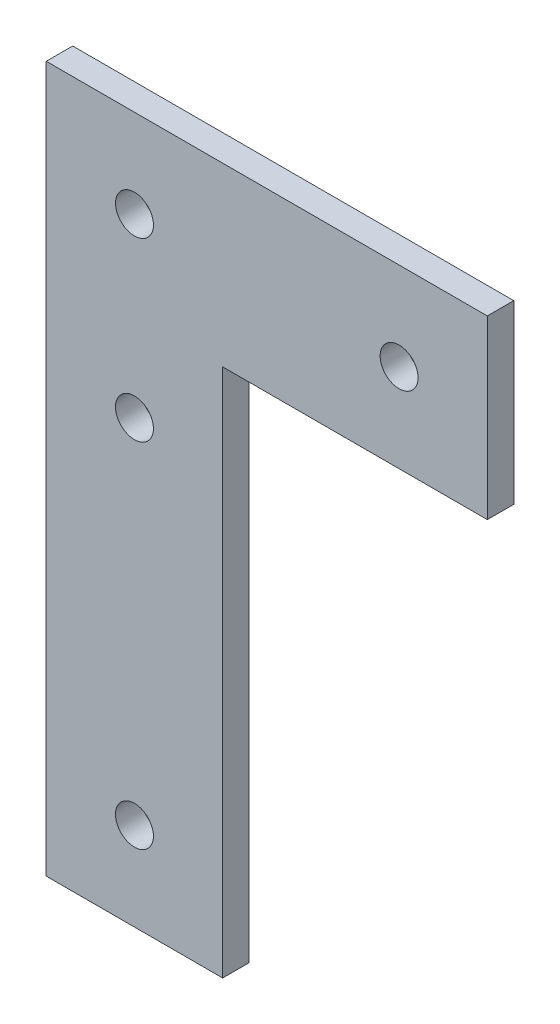
ISO-10303-21;
HEADER;
FILE_DESCRIPTION(('STEP AP214'),'2;1');
FILE_NAME('part.step','',(''),(''),'','','');
FILE_SCHEMA(('AUTOMOTIVE_DESIGN { 1 0 10303 214 1 1 1 1 }'));
ENDSEC;
DATA;
#1=APPLICATION_CONTEXT('core data for automotive mechanical design processes');
#2=APPLICATION_PROTOCOL_DEFINITION('international standard','automotive_design',2000,#1);
#3=PRODUCT_CONTEXT('',#1,'mechanical');
#4=PRODUCT('Part','Part','',(#3));
#5=PRODUCT_RELATED_PRODUCT_CATEGORY('part','',(#4));
#6=PRODUCT_DEFINITION_FORMATION('','',#4);
#7=PRODUCT_DEFINITION_CONTEXT('part definition',#1,'design');
#8=PRODUCT_DEFINITION('design','',#6,#7);
#9=PRODUCT_DEFINITION_SHAPE('','',#8);
#10=(LENGTH_UNIT() NAMED_UNIT(*) SI_UNIT(.MILLI.,.METRE.));
#11=(NAMED_UNIT(*) PLANE_ANGLE_UNIT() SI_UNIT($,.RADIAN.));
#12=(NAMED_UNIT(*) SI_UNIT($,.STERADIAN.) SOLID_ANGLE_UNIT());
#13=UNCERTAINTY_MEASURE_WITH_UNIT(LENGTH_MEASURE(1.E-05),#10,'distance_accuracy_value','');
#14=(GEOMETRIC_REPRESENTATION_CONTEXT(3) GLOBAL_UNCERTAINTY_ASSIGNED_CONTEXT((#13)) GLOBAL_UNIT_ASSIGNED_CONTEXT((#10,
#11,#12)) REPRESENTATION_CONTEXT('',''));
#15=CARTESIAN_POINT('',(0.,0.,0.));
#16=DIRECTION('',(0.,0.,1.));
#17=DIRECTION('',(1.,0.,0.));
#18=AXIS2_PLACEMENT_3D('',#15,#16,#17);
#19=CARTESIAN_POINT('',(0.,0.,3.));
#20=DIRECTION('',(0.,0.,-1.));
#21=DIRECTION('',(-1.,0.,0.));
#22=AXIS2_PLACEMENT_3D('',#19,#20,#21);
#23=PLANE('',#22);
#24=DIRECTION('',(0.,1.,0.));
#25=VECTOR('',#24,1.);
#26=CARTESIAN_POINT('',(-300.612129760226,147.905049365304,3.));
#27=LINE('',#26,#25);
#28=CARTESIAN_POINT('',(-300.612129760226,127.905049365303,3.));
#29=VERTEX_POINT('',#28);
#30=CARTESIAN_POINT('',(-300.612129760226,147.905049365304,3.));
#31=VERTEX_POINT('',#30);
#32=EDGE_CURVE('E132',#29,#31,#27,.T.);
#33=ORIENTED_EDGE('',*,*,#32,.T.);
#34=DIRECTION('',(-1.,0.,0.));
#35=VECTOR('',#34,1.);
#36=CARTESIAN_POINT('',(-300.612129760226,147.905049365304,3.));
#37=LINE('',#36,#35);
#38=CARTESIAN_POINT('',(-350.612129760226,147.905049365304,3.));
#39=VERTEX_POINT('',#38);
#40=EDGE_CURVE('E89',#31,#39,#37,.T.);
#41=ORIENTED_EDGE('',*,*,#40,.T.);
#42=DIRECTION('',(0.,-1.,0.));
#43=VECTOR('',#42,1.);
#44=CARTESIAN_POINT('',(-350.612129760226,147.905049365304,3.));
#45=LINE('',#44,#43);
#46=CARTESIAN_POINT('',(-350.612129760226,67.9050493653035,3.));
#47=VERTEX_POINT('',#46);
#48=EDGE_CURVE('E102',#39,#47,#45,.T.);
#49=ORIENTED_EDGE('',*,*,#48,.T.);
#50=DIRECTION('',(1.,0.,0.));
#51=VECTOR('',#50,1.);
#52=CARTESIAN_POINT('',(-350.612129760226,67.9050493653035,3.));
#53=LINE('',#52,#51);
#54=CARTESIAN_POINT('',(-330.612129760226,67.9050493653035,3.));
#55=VERTEX_POINT('',#54);
#56=EDGE_CURVE('E96',#47,#55,#53,.T.);
#57=ORIENTED_EDGE('',*,*,#56,.T.);
#58=DIRECTION('',(0.,1.,0.));
#59=VECTOR('',#58,1.);
#60=CARTESIAN_POINT('',(-330.612129760226,67.9050493653035,3.));
#61=LINE('',#60,#59);
#62=CARTESIAN_POINT('',(-330.612129760226,127.905049365303,3.));
#63=VERTEX_POINT('',#62);
#64=EDGE_CURVE('E100',#55,#63,#61,.T.);
#65=ORIENTED_EDGE('',*,*,#64,.T.);
#66=DIRECTION('',(1.,0.,0.));
#67=VECTOR('',#66,1.);
#68=CARTESIAN_POINT('',(-300.612129760226,127.905049365303,3.));
#69=LINE('',#68,#67);
#70=EDGE_CURVE('E52',#63,#29,#69,.T.);
#71=ORIENTED_EDGE('',*,*,#70,.T.);
#72=EDGE_LOOP('',(#33,#41,#49,#57,#65,#71));
#73=FACE_BOUND('',#72,.T.);
#74=CARTESIAN_POINT('',(-340.612129760226,77.9050493653034,3.));
#75=DIRECTION('',(0.,0.,1.));
#76=DIRECTION('',(1.,0.,0.));
#77=AXIS2_PLACEMENT_3D('',#74,#75,#76);
#78=CIRCLE('',#77,2.15000000000007);
#79=CARTESIAN_POINT('',(-338.462129760226,77.9050493653034,3.));
#80=VERTEX_POINT('',#79);
#81=EDGE_CURVE('E124',#80,#80,#78,.T.);
#82=ORIENTED_EDGE('',*,*,#81,.F.);
#83=EDGE_LOOP('',(#82));
#84=FACE_BOUND('',#83,.T.);
#85=CARTESIAN_POINT('',(-340.612129760226,117.905049365303,3.));
#86=DIRECTION('',(0.,0.,1.));
#87=DIRECTION('',(1.,0.,0.));
#88=AXIS2_PLACEMENT_3D('',#85,#86,#87);
#89=CIRCLE('',#88,2.15000000000007);
#90=CARTESIAN_POINT('',(-338.462129760226,117.905049365303,3.));
#91=VERTEX_POINT('',#90);
#92=EDGE_CURVE('E196',#91,#91,#89,.T.);
#93=ORIENTED_EDGE('',*,*,#92,.F.);
#94=EDGE_LOOP('',(#93));
#95=FACE_BOUND('',#94,.T.);
#96=CARTESIAN_POINT('',(-340.612129760226,137.905049365303,3.));
#97=DIRECTION('',(0.,0.,1.));
#98=DIRECTION('',(1.,0.,0.));
#99=AXIS2_PLACEMENT_3D('',#96,#97,#98);
#100=CIRCLE('',#99,2.15000000000007);
#101=CARTESIAN_POINT('',(-338.462129760226,137.905049365303,3.));
#102=VERTEX_POINT('',#101);
#103=EDGE_CURVE('E190',#102,#102,#100,.T.);
#104=ORIENTED_EDGE('',*,*,#103,.F.);
#105=EDGE_LOOP('',(#104));
#106=FACE_BOUND('',#105,.T.);
#107=CARTESIAN_POINT('',(-310.612129760226,137.905049365303,3.));
#108=DIRECTION('',(0.,0.,1.));
#109=DIRECTION('',(1.,0.,0.));
#110=AXIS2_PLACEMENT_3D('',#107,#108,#109);
#111=CIRCLE('',#110,2.15000000000007);
#112=CARTESIAN_POINT('',(-308.462129760226,137.905049365303,3.));
#113=VERTEX_POINT('',#112);
#114=EDGE_CURVE('E181',#113,#113,#111,.T.);
#115=ORIENTED_EDGE('',*,*,#114,.F.);
#116=EDGE_LOOP('',(#115));
#117=FACE_BOUND('',#116,.T.);
#118=ADVANCED_FACE('F35',(#73,#84,#95,#106,#117),#23,.F.);
#119=CARTESIAN_POINT('',(0.,0.,0.));
#120=DIRECTION('',(0.,0.,-1.));
#121=DIRECTION('',(-1.,0.,0.));
#122=AXIS2_PLACEMENT_3D('',#119,#120,#121);
#123=PLANE('',#122);
#124=CARTESIAN_POINT('',(-340.612129760226,137.905049365303,0.));
#125=DIRECTION('',(0.,0.,1.));
#126=DIRECTION('',(1.,0.,0.));
#127=AXIS2_PLACEMENT_3D('',#124,#125,#126);
#128=CIRCLE('',#127,2.15000000000007);
#129=CARTESIAN_POINT('',(-338.462129760226,137.905049365303,0.));
#130=VERTEX_POINT('',#129);
#131=EDGE_CURVE('E187',#130,#130,#128,.T.);
#132=ORIENTED_EDGE('',*,*,#131,.T.);
#133=EDGE_LOOP('',(#132));
#134=FACE_BOUND('',#133,.T.);
#135=CARTESIAN_POINT('',(-340.612129760226,77.9050493653034,0.));
#136=DIRECTION('',(0.,0.,1.));
#137=DIRECTION('',(1.,0.,0.));
#138=AXIS2_PLACEMENT_3D('',#135,#136,#137);
#139=CIRCLE('',#138,2.15000000000007);
#140=CARTESIAN_POINT('',(-338.462129760226,77.9050493653034,0.));
#141=VERTEX_POINT('',#140);
#142=EDGE_CURVE('E199',#141,#141,#139,.T.);
#143=ORIENTED_EDGE('',*,*,#142,.T.);
#144=EDGE_LOOP('',(#143));
#145=FACE_BOUND('',#144,.T.);
#146=DIRECTION('',(0.,1.,0.));
#147=VECTOR('',#146,1.);
#148=CARTESIAN_POINT('',(-300.612129760226,147.905049365304,0.));
#149=LINE('',#148,#147);
#150=CARTESIAN_POINT('',(-300.612129760226,127.905049365303,0.));
#151=VERTEX_POINT('',#150);
#152=CARTESIAN_POINT('',(-300.612129760226,147.905049365304,0.));
#153=VERTEX_POINT('',#152);
#154=EDGE_CURVE('E120',#151,#153,#149,.T.);
#155=ORIENTED_EDGE('',*,*,#154,.F.);
#156=DIRECTION('',(1.,0.,0.));
#157=VECTOR('',#156,1.);
#158=CARTESIAN_POINT('',(-300.612129760226,127.905049365303,0.));
#159=LINE('',#158,#157);
#160=CARTESIAN_POINT('',(-330.612129760226,127.905049365303,0.));
#161=VERTEX_POINT('',#160);
#162=EDGE_CURVE('E81',#161,#151,#159,.T.);
#163=ORIENTED_EDGE('',*,*,#162,.F.);
#164=DIRECTION('',(0.,1.,0.));
#165=VECTOR('',#164,1.);
#166=CARTESIAN_POINT('',(-330.612129760226,67.9050493653035,0.));
#167=LINE('',#166,#165);
#168=CARTESIAN_POINT('',(-330.612129760226,67.9050493653035,0.));
#169=VERTEX_POINT('',#168);
#170=EDGE_CURVE('E75',#169,#161,#167,.T.);
#171=ORIENTED_EDGE('',*,*,#170,.F.);
#172=DIRECTION('',(1.,0.,0.));
#173=VECTOR('',#172,1.);
#174=CARTESIAN_POINT('',(-350.612129760226,67.9050493653035,0.));
#175=LINE('',#174,#173);
#176=CARTESIAN_POINT('',(-350.612129760226,67.9050493653035,0.));
#177=VERTEX_POINT('',#176);
#178=EDGE_CURVE('E110',#177,#169,#175,.T.);
#179=ORIENTED_EDGE('',*,*,#178,.F.);
#180=DIRECTION('',(0.,-1.,0.));
#181=VECTOR('',#180,1.);
#182=CARTESIAN_POINT('',(-350.612129760226,67.9050493653035,0.));
#183=LINE('',#182,#181);
#184=CARTESIAN_POINT('',(-350.612129760226,147.905049365304,0.));
#185=VERTEX_POINT('',#184);
#186=EDGE_CURVE('E127',#185,#177,#183,.T.);
#187=ORIENTED_EDGE('',*,*,#186,.F.);
#188=DIRECTION('',(-1.,0.,0.));
#189=VECTOR('',#188,1.);
#190=CARTESIAN_POINT('',(-300.612129760226,147.905049365304,0.));
#191=LINE('',#190,#189);
#192=EDGE_CURVE('E123',#153,#185,#191,.T.);
#193=ORIENTED_EDGE('',*,*,#192,.F.);
#194=EDGE_LOOP('',(#155,#163,#171,#179,#187,#193));
#195=FACE_BOUND('',#194,.T.);
#196=CARTESIAN_POINT('',(-340.612129760226,117.905049365303,0.));
#197=DIRECTION('',(0.,0.,1.));
#198=DIRECTION('',(1.,0.,0.));
#199=AXIS2_PLACEMENT_3D('',#196,#197,#198);
#200=CIRCLE('',#199,2.15000000000007);
#201=CARTESIAN_POINT('',(-338.462129760226,117.905049365303,0.));
#202=VERTEX_POINT('',#201);
#203=EDGE_CURVE('E193',#202,#202,#200,.T.);
#204=ORIENTED_EDGE('',*,*,#203,.T.);
#205=EDGE_LOOP('',(#204));
#206=FACE_BOUND('',#205,.T.);
#207=CARTESIAN_POINT('',(-310.612129760226,137.905049365303,0.));
#208=DIRECTION('',(0.,0.,1.));
#209=DIRECTION('',(1.,0.,0.));
#210=AXIS2_PLACEMENT_3D('',#207,#208,#209);
#211=CIRCLE('',#210,2.15000000000007);
#212=CARTESIAN_POINT('',(-308.462129760226,137.905049365303,0.));
#213=VERTEX_POINT('',#212);
#214=EDGE_CURVE('E184',#213,#213,#211,.T.);
#215=ORIENTED_EDGE('',*,*,#214,.T.);
#216=EDGE_LOOP('',(#215));
#217=FACE_BOUND('',#216,.T.);
#218=ADVANCED_FACE('F142',(#134,#145,#195,#206,#217),#123,.T.);
#219=CARTESIAN_POINT('',(-300.612129760226,147.905049365304,3.));
#220=DIRECTION('',(-1.,0.,0.));
#221=DIRECTION('',(0.,0.,1.));
#222=AXIS2_PLACEMENT_3D('',#219,#220,#221);
#223=PLANE('',#222);
#224=ORIENTED_EDGE('',*,*,#154,.T.);
#225=DIRECTION('',(0.,0.,-1.));
#226=VECTOR('',#225,1.);
#227=CARTESIAN_POINT('',(-300.612129760226,147.905049365304,3.));
#228=LINE('',#227,#226);
#229=EDGE_CURVE('E11',#31,#153,#228,.T.);
#230=ORIENTED_EDGE('',*,*,#229,.F.);
#231=ORIENTED_EDGE('',*,*,#32,.F.);
#232=DIRECTION('',(0.,0.,-1.));
#233=VECTOR('',#232,1.);
#234=CARTESIAN_POINT('',(-300.612129760226,127.905049365303,3.));
#235=LINE('',#234,#233);
#236=EDGE_CURVE('E116',#29,#151,#235,.T.);
#237=ORIENTED_EDGE('',*,*,#236,.T.);
#238=EDGE_LOOP('',(#224,#230,#231,#237));
#239=FACE_BOUND('',#238,.T.);
#240=ADVANCED_FACE('F37',(#239),#223,.F.);
#241=CARTESIAN_POINT('',(-300.612129760226,147.905049365304,3.));
#242=DIRECTION('',(0.,-1.,0.));
#243=DIRECTION('',(0.,0.,-1.));
#244=AXIS2_PLACEMENT_3D('',#241,#242,#243);
#245=PLANE('',#244);
#246=ORIENTED_EDGE('',*,*,#192,.T.);
#247=DIRECTION('',(0.,0.,-1.));
#248=VECTOR('',#247,1.);
#249=CARTESIAN_POINT('',(-350.612129760226,147.905049365304,3.));
#250=LINE('',#249,#248);
#251=EDGE_CURVE('E44',#39,#185,#250,.T.);
#252=ORIENTED_EDGE('',*,*,#251,.F.);
#253=ORIENTED_EDGE('',*,*,#40,.F.);
#254=ORIENTED_EDGE('',*,*,#229,.T.);
#255=EDGE_LOOP('',(#246,#252,#253,#254));
#256=FACE_BOUND('',#255,.T.);
#257=ADVANCED_FACE('F138',(#256),#245,.F.);
#258=CARTESIAN_POINT('',(-350.612129760226,67.9050493653035,3.));
#259=DIRECTION('',(1.,0.,0.));
#260=DIRECTION('',(0.,0.,-1.));
#261=AXIS2_PLACEMENT_3D('',#258,#259,#260);
#262=PLANE('',#261);
#263=ORIENTED_EDGE('',*,*,#186,.T.);
#264=DIRECTION('',(0.,0.,-1.));
#265=VECTOR('',#264,1.);
#266=CARTESIAN_POINT('',(-350.612129760226,67.9050493653035,3.));
#267=LINE('',#266,#265);
#268=EDGE_CURVE('E111',#47,#177,#267,.T.);
#269=ORIENTED_EDGE('',*,*,#268,.F.);
#270=ORIENTED_EDGE('',*,*,#48,.F.);
#271=ORIENTED_EDGE('',*,*,#251,.T.);
#272=EDGE_LOOP('',(#263,#269,#270,#271));
#273=FACE_BOUND('',#272,.T.);
#274=ADVANCED_FACE('F137',(#273),#262,.F.);
#275=CARTESIAN_POINT('',(-350.612129760226,67.9050493653035,3.));
#276=DIRECTION('',(0.,1.,0.));
#277=DIRECTION('',(0.,0.,1.));
#278=AXIS2_PLACEMENT_3D('',#275,#276,#277);
#279=PLANE('',#278);
#280=ORIENTED_EDGE('',*,*,#178,.T.);
#281=DIRECTION('',(0.,0.,-1.));
#282=VECTOR('',#281,1.);
#283=CARTESIAN_POINT('',(-330.612129760226,67.9050493653035,3.));
#284=LINE('',#283,#282);
#285=EDGE_CURVE('E107',#55,#169,#284,.T.);
#286=ORIENTED_EDGE('',*,*,#285,.F.);
#287=ORIENTED_EDGE('',*,*,#56,.F.);
#288=ORIENTED_EDGE('',*,*,#268,.T.);
#289=EDGE_LOOP('',(#280,#286,#287,#288));
#290=FACE_BOUND('',#289,.T.);
#291=ADVANCED_FACE('F108',(#290),#279,.F.);
#292=CARTESIAN_POINT('',(-330.612129760226,67.9050493653035,3.));
#293=DIRECTION('',(-1.,0.,0.));
#294=DIRECTION('',(0.,0.,1.));
#295=AXIS2_PLACEMENT_3D('',#292,#293,#294);
#296=PLANE('',#295);
#297=ORIENTED_EDGE('',*,*,#170,.T.);
#298=DIRECTION('',(0.,0.,-1.));
#299=VECTOR('',#298,1.);
#300=CARTESIAN_POINT('',(-330.612129760226,127.905049365303,3.));
#301=LINE('',#300,#299);
#302=EDGE_CURVE('E112',#63,#161,#301,.T.);
#303=ORIENTED_EDGE('',*,*,#302,.F.);
#304=ORIENTED_EDGE('',*,*,#64,.F.);
#305=ORIENTED_EDGE('',*,*,#285,.T.);
#306=EDGE_LOOP('',(#297,#303,#304,#305));
#307=FACE_BOUND('',#306,.T.);
#308=ADVANCED_FACE('F114',(#307),#296,.F.);
#309=CARTESIAN_POINT('',(-300.612129760226,127.905049365303,3.));
#310=DIRECTION('',(0.,1.,0.));
#311=DIRECTION('',(0.,0.,1.));
#312=AXIS2_PLACEMENT_3D('',#309,#310,#311);
#313=PLANE('',#312);
#314=ORIENTED_EDGE('',*,*,#162,.T.);
#315=ORIENTED_EDGE('',*,*,#236,.F.);
#316=ORIENTED_EDGE('',*,*,#70,.F.);
#317=ORIENTED_EDGE('',*,*,#302,.T.);
#318=EDGE_LOOP('',(#314,#315,#316,#317));
#319=FACE_BOUND('',#318,.T.);
#320=ADVANCED_FACE('F146',(#319),#313,.F.);
#321=CARTESIAN_POINT('',(-340.612129760226,77.9050493653034,3.));
#322=DIRECTION('',(0.,0.,-1.));
#323=DIRECTION('',(-1.,0.,0.));
#324=AXIS2_PLACEMENT_3D('',#321,#322,#323);
#325=CYLINDRICAL_SURFACE('',#324,2.15000000000007);
#326=ORIENTED_EDGE('',*,*,#81,.T.);
#327=EDGE_LOOP('',(#326));
#328=FACE_BOUND('',#327,.T.);
#329=ORIENTED_EDGE('',*,*,#142,.F.);
#330=EDGE_LOOP('',(#329));
#331=FACE_BOUND('',#330,.T.);
#332=ADVANCED_FACE('F148',(#328,#331),#325,.F.);
#333=CARTESIAN_POINT('',(-340.612129760226,117.905049365303,3.));
#334=DIRECTION('',(0.,0.,-1.));
#335=DIRECTION('',(-1.,0.,0.));
#336=AXIS2_PLACEMENT_3D('',#333,#334,#335);
#337=CYLINDRICAL_SURFACE('',#336,2.15000000000007);
#338=ORIENTED_EDGE('',*,*,#92,.T.);
#339=EDGE_LOOP('',(#338));
#340=FACE_BOUND('',#339,.T.);
#341=ORIENTED_EDGE('',*,*,#203,.F.);
#342=EDGE_LOOP('',(#341));
#343=FACE_BOUND('',#342,.T.);
#344=ADVANCED_FACE('F154',(#340,#343),#337,.F.);
#345=CARTESIAN_POINT('',(-340.612129760226,137.905049365303,3.));
#346=DIRECTION('',(0.,0.,-1.));
#347=DIRECTION('',(-1.,0.,0.));
#348=AXIS2_PLACEMENT_3D('',#345,#346,#347);
#349=CYLINDRICAL_SURFACE('',#348,2.15000000000007);
#350=ORIENTED_EDGE('',*,*,#103,.T.);
#351=EDGE_LOOP('',(#350));
#352=FACE_BOUND('',#351,.T.);
#353=ORIENTED_EDGE('',*,*,#131,.F.);
#354=EDGE_LOOP('',(#353));
#355=FACE_BOUND('',#354,.T.);
#356=ADVANCED_FACE('F168',(#352,#355),#349,.F.);
#357=CARTESIAN_POINT('',(-310.612129760226,137.905049365303,3.));
#358=DIRECTION('',(0.,0.,-1.));
#359=DIRECTION('',(-1.,0.,0.));
#360=AXIS2_PLACEMENT_3D('',#357,#358,#359);
#361=CYLINDRICAL_SURFACE('',#360,2.15000000000007);
#362=ORIENTED_EDGE('',*,*,#114,.T.);
#363=EDGE_LOOP('',(#362));
#364=FACE_BOUND('',#363,.T.);
#365=ORIENTED_EDGE('',*,*,#214,.F.);
#366=EDGE_LOOP('',(#365));
#367=FACE_BOUND('',#366,.T.);
#368=ADVANCED_FACE('F172',(#364,#367),#361,.F.);
#369=CLOSED_SHELL('',(#118,#218,#240,#257,#274,#291,#308,#320,#332,#344,#356,#368));
#370=MANIFOLD_SOLID_BREP('B2',#369);
#371=ADVANCED_BREP_SHAPE_REPRESENTATION('',(#18,#370),#14);
#372=SHAPE_DEFINITION_REPRESENTATION(#9,#371);
ENDSEC;
END-ISO-10303-21;
